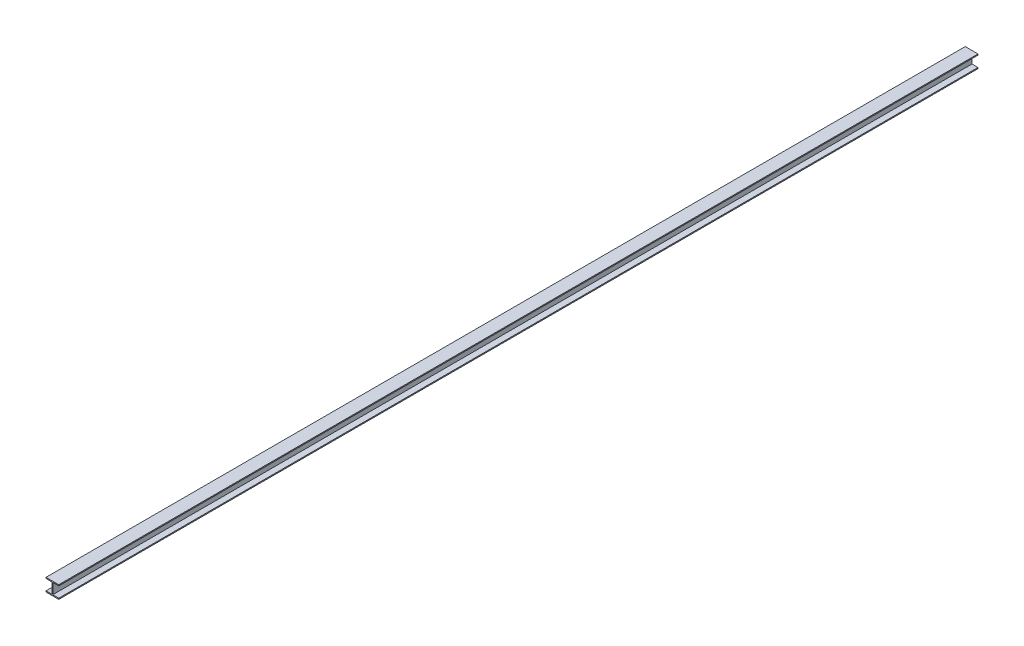
ISO-10303-21;
HEADER;
FILE_DESCRIPTION(('STEP AP214'),'2;1');
FILE_NAME('part.step','',(''),(''),'','','');
FILE_SCHEMA(('AUTOMOTIVE_DESIGN { 1 0 10303 214 1 1 1 1 }'));
ENDSEC;
DATA;
#1=APPLICATION_CONTEXT('core data for automotive mechanical design processes');
#2=APPLICATION_PROTOCOL_DEFINITION('international standard','automotive_design',2000,#1);
#3=PRODUCT_CONTEXT('',#1,'mechanical');
#4=PRODUCT('Part','Part','',(#3));
#5=PRODUCT_RELATED_PRODUCT_CATEGORY('part','',(#4));
#6=PRODUCT_DEFINITION_FORMATION('','',#4);
#7=PRODUCT_DEFINITION_CONTEXT('part definition',#1,'design');
#8=PRODUCT_DEFINITION('design','',#6,#7);
#9=PRODUCT_DEFINITION_SHAPE('','',#8);
#10=(LENGTH_UNIT() NAMED_UNIT(*) SI_UNIT(.MILLI.,.METRE.));
#11=(NAMED_UNIT(*) PLANE_ANGLE_UNIT() SI_UNIT($,.RADIAN.));
#12=(NAMED_UNIT(*) SI_UNIT($,.STERADIAN.) SOLID_ANGLE_UNIT());
#13=UNCERTAINTY_MEASURE_WITH_UNIT(LENGTH_MEASURE(1.E-05),#10,'distance_accuracy_value','');
#14=(GEOMETRIC_REPRESENTATION_CONTEXT(3) GLOBAL_UNCERTAINTY_ASSIGNED_CONTEXT((#13)) GLOBAL_UNIT_ASSIGNED_CONTEXT((#10,
#11,#12)) REPRESENTATION_CONTEXT('',''));
#15=CARTESIAN_POINT('',(0.,0.,0.));
#16=DIRECTION('',(0.,0.,1.));
#17=DIRECTION('',(1.,0.,0.));
#18=AXIS2_PLACEMENT_3D('',#15,#16,#17);
#19=CARTESIAN_POINT('',(-63.5,106.0704,4572.));
#20=DIRECTION('',(1.,0.,0.));
#21=DIRECTION('',(0.,1.,0.));
#22=AXIS2_PLACEMENT_3D('',#19,#20,#21);
#23=PLANE('',#22);
#24=DIRECTION('',(0.,-1.,0.));
#25=VECTOR('',#24,1.);
#26=CARTESIAN_POINT('',(-63.5,106.0704,-4572.));
#27=LINE('',#26,#25);
#28=CARTESIAN_POINT('',(-63.5,116.5352,-4572.));
#29=VERTEX_POINT('',#28);
#30=CARTESIAN_POINT('',(-63.5,106.0704,-4572.));
#31=VERTEX_POINT('',#30);
#32=EDGE_CURVE('E154',#29,#31,#27,.T.);
#33=ORIENTED_EDGE('',*,*,#32,.T.);
#34=DIRECTION('',(0.,0.,-1.));
#35=VECTOR('',#34,1.);
#36=CARTESIAN_POINT('',(-63.5,106.0704,4572.));
#37=LINE('',#36,#35);
#38=CARTESIAN_POINT('',(-63.5,106.0704,4572.));
#39=VERTEX_POINT('',#38);
#40=EDGE_CURVE('E11',#39,#31,#37,.T.);
#41=ORIENTED_EDGE('',*,*,#40,.F.);
#42=DIRECTION('',(0.,-1.,0.));
#43=VECTOR('',#42,1.);
#44=CARTESIAN_POINT('',(-63.5,106.0704,4572.));
#45=LINE('',#44,#43);
#46=CARTESIAN_POINT('',(-63.5,116.5352,4572.));
#47=VERTEX_POINT('',#46);
#48=EDGE_CURVE('E176',#47,#39,#45,.T.);
#49=ORIENTED_EDGE('',*,*,#48,.F.);
#50=DIRECTION('',(0.,0.,-1.));
#51=VECTOR('',#50,1.);
#52=CARTESIAN_POINT('',(-63.5,116.5352,4572.));
#53=LINE('',#52,#51);
#54=EDGE_CURVE('E150',#47,#29,#53,.T.);
#55=ORIENTED_EDGE('',*,*,#54,.T.);
#56=EDGE_LOOP('',(#33,#41,#49,#55));
#57=FACE_BOUND('',#56,.T.);
#58=ADVANCED_FACE('F34',(#57),#23,.F.);
#59=CARTESIAN_POINT('',(-3.9751,106.0704,4572.));
#60=DIRECTION('',(0.,1.,0.));
#61=DIRECTION('',(-1.,0.,0.));
#62=AXIS2_PLACEMENT_3D('',#59,#60,#61);
#63=PLANE('',#62);
#64=DIRECTION('',(1.,0.,0.));
#65=VECTOR('',#64,1.);
#66=CARTESIAN_POINT('',(-3.9751,106.0704,-4572.));
#67=LINE('',#66,#65);
#68=CARTESIAN_POINT('',(-3.9751,106.0704,-4572.));
#69=VERTEX_POINT('',#68);
#70=EDGE_CURVE('E157',#31,#69,#67,.T.);
#71=ORIENTED_EDGE('',*,*,#70,.T.);
#72=DIRECTION('',(0.,0.,-1.));
#73=VECTOR('',#72,1.);
#74=CARTESIAN_POINT('',(-3.9751,106.0704,4572.));
#75=LINE('',#74,#73);
#76=CARTESIAN_POINT('',(-3.9751,106.0704,4572.));
#77=VERTEX_POINT('',#76);
#78=EDGE_CURVE('E42',#77,#69,#75,.T.);
#79=ORIENTED_EDGE('',*,*,#78,.F.);
#80=DIRECTION('',(1.,0.,0.));
#81=VECTOR('',#80,1.);
#82=CARTESIAN_POINT('',(-3.9751,106.0704,4572.));
#83=LINE('',#82,#81);
#84=EDGE_CURVE('E105',#39,#77,#83,.T.);
#85=ORIENTED_EDGE('',*,*,#84,.F.);
#86=ORIENTED_EDGE('',*,*,#40,.T.);
#87=EDGE_LOOP('',(#71,#79,#85,#86));
#88=FACE_BOUND('',#87,.T.);
#89=ADVANCED_FACE('F254',(#88),#63,.F.);
#90=CARTESIAN_POINT('',(-3.97510000000001,0.,4572.));
#91=DIRECTION('',(1.,0.,0.));
#92=DIRECTION('',(0.,1.,0.));
#93=AXIS2_PLACEMENT_3D('',#90,#91,#92);
#94=PLANE('',#93);
#95=DIRECTION('',(0.,-1.,0.));
#96=VECTOR('',#95,1.);
#97=CARTESIAN_POINT('',(-3.97510000000001,0.,-4572.));
#98=LINE('',#97,#96);
#99=CARTESIAN_POINT('',(-3.97510000000001,0.,-4572.));
#100=VERTEX_POINT('',#99);
#101=EDGE_CURVE('E159',#69,#100,#98,.T.);
#102=ORIENTED_EDGE('',*,*,#101,.T.);
#103=DIRECTION('',(0.,0.,-1.));
#104=VECTOR('',#103,1.);
#105=CARTESIAN_POINT('',(-3.97510000000001,0.,4572.));
#106=LINE('',#105,#104);
#107=CARTESIAN_POINT('',(-3.97510000000001,0.,4572.));
#108=VERTEX_POINT('',#107);
#109=EDGE_CURVE('E195',#108,#100,#106,.T.);
#110=ORIENTED_EDGE('',*,*,#109,.F.);
#111=DIRECTION('',(0.,-1.,0.));
#112=VECTOR('',#111,1.);
#113=CARTESIAN_POINT('',(-3.97510000000001,0.,4572.));
#114=LINE('',#113,#112);
#115=EDGE_CURVE('E203',#77,#108,#114,.T.);
#116=ORIENTED_EDGE('',*,*,#115,.F.);
#117=ORIENTED_EDGE('',*,*,#78,.T.);
#118=EDGE_LOOP('',(#102,#110,#116,#117));
#119=FACE_BOUND('',#118,.T.);
#120=ADVANCED_FACE('F201',(#119),#94,.F.);
#121=CARTESIAN_POINT('',(-63.5,0.,4572.));
#122=DIRECTION('',(0.,-1.,0.));
#123=DIRECTION('',(0.,0.,-1.));
#124=AXIS2_PLACEMENT_3D('',#121,#122,#123);
#125=PLANE('',#124);
#126=DIRECTION('',(-1.,0.,0.));
#127=VECTOR('',#126,1.);
#128=CARTESIAN_POINT('',(-63.5,0.,-4572.));
#129=LINE('',#128,#127);
#130=CARTESIAN_POINT('',(-63.5,0.,-4572.));
#131=VERTEX_POINT('',#130);
#132=EDGE_CURVE('E161',#100,#131,#129,.T.);
#133=ORIENTED_EDGE('',*,*,#132,.T.);
#134=DIRECTION('',(0.,0.,-1.));
#135=VECTOR('',#134,1.);
#136=CARTESIAN_POINT('',(-63.5,0.,4572.));
#137=LINE('',#136,#135);
#138=CARTESIAN_POINT('',(-63.5,0.,4572.));
#139=VERTEX_POINT('',#138);
#140=EDGE_CURVE('E192',#139,#131,#137,.T.);
#141=ORIENTED_EDGE('',*,*,#140,.F.);
#142=DIRECTION('',(-1.,0.,0.));
#143=VECTOR('',#142,1.);
#144=CARTESIAN_POINT('',(-63.5,0.,4572.));
#145=LINE('',#144,#143);
#146=EDGE_CURVE('E221',#108,#139,#145,.T.);
#147=ORIENTED_EDGE('',*,*,#146,.F.);
#148=ORIENTED_EDGE('',*,*,#109,.T.);
#149=EDGE_LOOP('',(#133,#141,#147,#148));
#150=FACE_BOUND('',#149,.T.);
#151=ADVANCED_FACE('F212',(#150),#125,.F.);
#152=CARTESIAN_POINT('',(-63.5,-10.4648,4572.));
#153=DIRECTION('',(1.,0.,0.));
#154=DIRECTION('',(0.,1.,0.));
#155=AXIS2_PLACEMENT_3D('',#152,#153,#154);
#156=PLANE('',#155);
#157=DIRECTION('',(0.,-1.,0.));
#158=VECTOR('',#157,1.);
#159=CARTESIAN_POINT('',(-63.5,-10.4648,-4572.));
#160=LINE('',#159,#158);
#161=CARTESIAN_POINT('',(-63.5,-10.4648,-4572.));
#162=VERTEX_POINT('',#161);
#163=EDGE_CURVE('E163',#131,#162,#160,.T.);
#164=ORIENTED_EDGE('',*,*,#163,.T.);
#165=DIRECTION('',(0.,0.,-1.));
#166=VECTOR('',#165,1.);
#167=CARTESIAN_POINT('',(-63.5,-10.4648,4572.));
#168=LINE('',#167,#166);
#169=CARTESIAN_POINT('',(-63.5,-10.4648,4572.));
#170=VERTEX_POINT('',#169);
#171=EDGE_CURVE('E189',#170,#162,#168,.T.);
#172=ORIENTED_EDGE('',*,*,#171,.F.);
#173=DIRECTION('',(0.,-1.,0.));
#174=VECTOR('',#173,1.);
#175=CARTESIAN_POINT('',(-63.5,-10.4648,4572.));
#176=LINE('',#175,#174);
#177=EDGE_CURVE('E218',#139,#170,#176,.T.);
#178=ORIENTED_EDGE('',*,*,#177,.F.);
#179=ORIENTED_EDGE('',*,*,#140,.T.);
#180=EDGE_LOOP('',(#164,#172,#178,#179));
#181=FACE_BOUND('',#180,.T.);
#182=ADVANCED_FACE('F216',(#181),#156,.F.);
#183=CARTESIAN_POINT('',(63.5,-10.4648,4572.));
#184=DIRECTION('',(0.,1.,0.));
#185=DIRECTION('',(0.,0.,1.));
#186=AXIS2_PLACEMENT_3D('',#183,#184,#185);
#187=PLANE('',#186);
#188=DIRECTION('',(1.,0.,0.));
#189=VECTOR('',#188,1.);
#190=CARTESIAN_POINT('',(63.5,-10.4648,-4572.));
#191=LINE('',#190,#189);
#192=CARTESIAN_POINT('',(63.5,-10.4648,-4572.));
#193=VERTEX_POINT('',#192);
#194=EDGE_CURVE('E165',#162,#193,#191,.T.);
#195=ORIENTED_EDGE('',*,*,#194,.T.);
#196=DIRECTION('',(0.,0.,-1.));
#197=VECTOR('',#196,1.);
#198=CARTESIAN_POINT('',(63.5,-10.4648,4572.));
#199=LINE('',#198,#197);
#200=CARTESIAN_POINT('',(63.5,-10.4648,4572.));
#201=VERTEX_POINT('',#200);
#202=EDGE_CURVE('E186',#201,#193,#199,.T.);
#203=ORIENTED_EDGE('',*,*,#202,.F.);
#204=DIRECTION('',(1.,0.,0.));
#205=VECTOR('',#204,1.);
#206=CARTESIAN_POINT('',(63.5,-10.4648,4572.));
#207=LINE('',#206,#205);
#208=EDGE_CURVE('E220',#170,#201,#207,.T.);
#209=ORIENTED_EDGE('',*,*,#208,.F.);
#210=ORIENTED_EDGE('',*,*,#171,.T.);
#211=EDGE_LOOP('',(#195,#203,#209,#210));
#212=FACE_BOUND('',#211,.T.);
#213=ADVANCED_FACE('F267',(#212),#187,.F.);
#214=CARTESIAN_POINT('',(63.5,0.,4572.));
#215=DIRECTION('',(-1.,0.,0.));
#216=DIRECTION('',(0.,-1.,0.));
#217=AXIS2_PLACEMENT_3D('',#214,#215,#216);
#218=PLANE('',#217);
#219=DIRECTION('',(0.,1.,0.));
#220=VECTOR('',#219,1.);
#221=CARTESIAN_POINT('',(63.5,0.,-4572.));
#222=LINE('',#221,#220);
#223=CARTESIAN_POINT('',(63.5,0.,-4572.));
#224=VERTEX_POINT('',#223);
#225=EDGE_CURVE('E167',#193,#224,#222,.T.);
#226=ORIENTED_EDGE('',*,*,#225,.T.);
#227=DIRECTION('',(0.,0.,-1.));
#228=VECTOR('',#227,1.);
#229=CARTESIAN_POINT('',(63.5,0.,4572.));
#230=LINE('',#229,#228);
#231=CARTESIAN_POINT('',(63.5,0.,4572.));
#232=VERTEX_POINT('',#231);
#233=EDGE_CURVE('E183',#232,#224,#230,.T.);
#234=ORIENTED_EDGE('',*,*,#233,.F.);
#235=DIRECTION('',(0.,1.,0.));
#236=VECTOR('',#235,1.);
#237=CARTESIAN_POINT('',(63.5,0.,4572.));
#238=LINE('',#237,#236);
#239=EDGE_CURVE('E223',#201,#232,#238,.T.);
#240=ORIENTED_EDGE('',*,*,#239,.F.);
#241=ORIENTED_EDGE('',*,*,#202,.T.);
#242=EDGE_LOOP('',(#226,#234,#240,#241));
#243=FACE_BOUND('',#242,.T.);
#244=ADVANCED_FACE('F270',(#243),#218,.F.);
#245=CARTESIAN_POINT('',(3.97510000000001,0.,4572.));
#246=DIRECTION('',(0.,-1.,0.));
#247=DIRECTION('',(0.,0.,-1.));
#248=AXIS2_PLACEMENT_3D('',#245,#246,#247);
#249=PLANE('',#248);
#250=DIRECTION('',(-1.,0.,0.));
#251=VECTOR('',#250,1.);
#252=CARTESIAN_POINT('',(3.97510000000001,0.,-4572.));
#253=LINE('',#252,#251);
#254=CARTESIAN_POINT('',(3.97510000000001,0.,-4572.));
#255=VERTEX_POINT('',#254);
#256=EDGE_CURVE('E169',#224,#255,#253,.T.);
#257=ORIENTED_EDGE('',*,*,#256,.T.);
#258=DIRECTION('',(0.,0.,-1.));
#259=VECTOR('',#258,1.);
#260=CARTESIAN_POINT('',(3.97510000000001,0.,4572.));
#261=LINE('',#260,#259);
#262=CARTESIAN_POINT('',(3.97510000000001,0.,4572.));
#263=VERTEX_POINT('',#262);
#264=EDGE_CURVE('E180',#263,#255,#261,.T.);
#265=ORIENTED_EDGE('',*,*,#264,.F.);
#266=DIRECTION('',(-1.,0.,0.));
#267=VECTOR('',#266,1.);
#268=CARTESIAN_POINT('',(3.97510000000001,0.,4572.));
#269=LINE('',#268,#267);
#270=EDGE_CURVE('E229',#232,#263,#269,.T.);
#271=ORIENTED_EDGE('',*,*,#270,.F.);
#272=ORIENTED_EDGE('',*,*,#233,.T.);
#273=EDGE_LOOP('',(#257,#265,#271,#272));
#274=FACE_BOUND('',#273,.T.);
#275=ADVANCED_FACE('F235',(#274),#249,.F.);
#276=CARTESIAN_POINT('',(3.9751,106.0704,4572.));
#277=DIRECTION('',(-1.,0.,0.));
#278=DIRECTION('',(0.,-1.,0.));
#279=AXIS2_PLACEMENT_3D('',#276,#277,#278);
#280=PLANE('',#279);
#281=DIRECTION('',(0.,1.,0.));
#282=VECTOR('',#281,1.);
#283=CARTESIAN_POINT('',(3.9751,106.0704,-4572.));
#284=LINE('',#283,#282);
#285=CARTESIAN_POINT('',(3.9751,106.0704,-4572.));
#286=VERTEX_POINT('',#285);
#287=EDGE_CURVE('E171',#255,#286,#284,.T.);
#288=ORIENTED_EDGE('',*,*,#287,.T.);
#289=DIRECTION('',(0.,0.,-1.));
#290=VECTOR('',#289,1.);
#291=CARTESIAN_POINT('',(3.9751,106.0704,4572.));
#292=LINE('',#291,#290);
#293=CARTESIAN_POINT('',(3.9751,106.0704,4572.));
#294=VERTEX_POINT('',#293);
#295=EDGE_CURVE('E145',#294,#286,#292,.T.);
#296=ORIENTED_EDGE('',*,*,#295,.F.);
#297=DIRECTION('',(0.,1.,0.));
#298=VECTOR('',#297,1.);
#299=CARTESIAN_POINT('',(3.9751,106.0704,4572.));
#300=LINE('',#299,#298);
#301=EDGE_CURVE('E136',#263,#294,#300,.T.);
#302=ORIENTED_EDGE('',*,*,#301,.F.);
#303=ORIENTED_EDGE('',*,*,#264,.T.);
#304=EDGE_LOOP('',(#288,#296,#302,#303));
#305=FACE_BOUND('',#304,.T.);
#306=ADVANCED_FACE('F239',(#305),#280,.F.);
#307=CARTESIAN_POINT('',(63.5,106.0704,4572.));
#308=DIRECTION('',(0.,1.,0.));
#309=DIRECTION('',(-1.,0.,0.));
#310=AXIS2_PLACEMENT_3D('',#307,#308,#309);
#311=PLANE('',#310);
#312=DIRECTION('',(1.,0.,0.));
#313=VECTOR('',#312,1.);
#314=CARTESIAN_POINT('',(63.5,106.0704,-4572.));
#315=LINE('',#314,#313);
#316=CARTESIAN_POINT('',(63.5,106.0704,-4572.));
#317=VERTEX_POINT('',#316);
#318=EDGE_CURVE('E144',#286,#317,#315,.T.);
#319=ORIENTED_EDGE('',*,*,#318,.T.);
#320=DIRECTION('',(0.,0.,-1.));
#321=VECTOR('',#320,1.);
#322=CARTESIAN_POINT('',(63.5,106.0704,4572.));
#323=LINE('',#322,#321);
#324=CARTESIAN_POINT('',(63.5,106.0704,4572.));
#325=VERTEX_POINT('',#324);
#326=EDGE_CURVE('E141',#325,#317,#323,.T.);
#327=ORIENTED_EDGE('',*,*,#326,.F.);
#328=DIRECTION('',(1.,0.,0.));
#329=VECTOR('',#328,1.);
#330=CARTESIAN_POINT('',(63.5,106.0704,4572.));
#331=LINE('',#330,#329);
#332=EDGE_CURVE('E130',#294,#325,#331,.T.);
#333=ORIENTED_EDGE('',*,*,#332,.F.);
#334=ORIENTED_EDGE('',*,*,#295,.T.);
#335=EDGE_LOOP('',(#319,#327,#333,#334));
#336=FACE_BOUND('',#335,.T.);
#337=ADVANCED_FACE('F142',(#336),#311,.F.);
#338=CARTESIAN_POINT('',(63.5,116.5352,4572.));
#339=DIRECTION('',(-1.,0.,0.));
#340=DIRECTION('',(0.,-1.,0.));
#341=AXIS2_PLACEMENT_3D('',#338,#339,#340);
#342=PLANE('',#341);
#343=DIRECTION('',(0.,1.,0.));
#344=VECTOR('',#343,1.);
#345=CARTESIAN_POINT('',(63.5,116.5352,-4572.));
#346=LINE('',#345,#344);
#347=CARTESIAN_POINT('',(63.5,116.5352,-4572.));
#348=VERTEX_POINT('',#347);
#349=EDGE_CURVE('E91',#317,#348,#346,.T.);
#350=ORIENTED_EDGE('',*,*,#349,.T.);
#351=DIRECTION('',(0.,0.,-1.));
#352=VECTOR('',#351,1.);
#353=CARTESIAN_POINT('',(63.5,116.5352,4572.));
#354=LINE('',#353,#352);
#355=CARTESIAN_POINT('',(63.5,116.5352,4572.));
#356=VERTEX_POINT('',#355);
#357=EDGE_CURVE('E146',#356,#348,#354,.T.);
#358=ORIENTED_EDGE('',*,*,#357,.F.);
#359=DIRECTION('',(0.,1.,0.));
#360=VECTOR('',#359,1.);
#361=CARTESIAN_POINT('',(63.5,116.5352,4572.));
#362=LINE('',#361,#360);
#363=EDGE_CURVE('E134',#325,#356,#362,.T.);
#364=ORIENTED_EDGE('',*,*,#363,.F.);
#365=ORIENTED_EDGE('',*,*,#326,.T.);
#366=EDGE_LOOP('',(#350,#358,#364,#365));
#367=FACE_BOUND('',#366,.T.);
#368=ADVANCED_FACE('F148',(#367),#342,.F.);
#369=CARTESIAN_POINT('',(-63.5,116.5352,4572.));
#370=DIRECTION('',(0.,-1.,0.));
#371=DIRECTION('',(0.,0.,-1.));
#372=AXIS2_PLACEMENT_3D('',#369,#370,#371);
#373=PLANE('',#372);
#374=DIRECTION('',(-1.,0.,0.));
#375=VECTOR('',#374,1.);
#376=CARTESIAN_POINT('',(-63.5,116.5352,-4572.));
#377=LINE('',#376,#375);
#378=EDGE_CURVE('E97',#348,#29,#377,.T.);
#379=ORIENTED_EDGE('',*,*,#378,.T.);
#380=ORIENTED_EDGE('',*,*,#54,.F.);
#381=DIRECTION('',(-1.,0.,0.));
#382=VECTOR('',#381,1.);
#383=CARTESIAN_POINT('',(-63.5,116.5352,4572.));
#384=LINE('',#383,#382);
#385=EDGE_CURVE('E50',#356,#47,#384,.T.);
#386=ORIENTED_EDGE('',*,*,#385,.F.);
#387=ORIENTED_EDGE('',*,*,#357,.T.);
#388=EDGE_LOOP('',(#379,#380,#386,#387));
#389=FACE_BOUND('',#388,.T.);
#390=ADVANCED_FACE('F243',(#389),#373,.F.);
#391=CARTESIAN_POINT('',(0.,0.,4572.));
#392=DIRECTION('',(0.,0.,-1.));
#393=DIRECTION('',(-1.,0.,0.));
#394=AXIS2_PLACEMENT_3D('',#391,#392,#393);
#395=PLANE('',#394);
#396=ORIENTED_EDGE('',*,*,#48,.T.);
#397=ORIENTED_EDGE('',*,*,#84,.T.);
#398=ORIENTED_EDGE('',*,*,#115,.T.);
#399=ORIENTED_EDGE('',*,*,#146,.T.);
#400=ORIENTED_EDGE('',*,*,#177,.T.);
#401=ORIENTED_EDGE('',*,*,#208,.T.);
#402=ORIENTED_EDGE('',*,*,#239,.T.);
#403=ORIENTED_EDGE('',*,*,#270,.T.);
#404=ORIENTED_EDGE('',*,*,#301,.T.);
#405=ORIENTED_EDGE('',*,*,#332,.T.);
#406=ORIENTED_EDGE('',*,*,#363,.T.);
#407=ORIENTED_EDGE('',*,*,#385,.T.);
#408=EDGE_LOOP('',(#396,#397,#398,#399,#400,#401,#402,#403,#404,#405,#406,#407));
#409=FACE_BOUND('',#408,.T.);
#410=ADVANCED_FACE('F132',(#409),#395,.F.);
#411=CARTESIAN_POINT('',(0.,0.,-4572.));
#412=DIRECTION('',(0.,0.,-1.));
#413=DIRECTION('',(-1.,0.,0.));
#414=AXIS2_PLACEMENT_3D('',#411,#412,#413);
#415=PLANE('',#414);
#416=ORIENTED_EDGE('',*,*,#32,.F.);
#417=ORIENTED_EDGE('',*,*,#378,.F.);
#418=ORIENTED_EDGE('',*,*,#349,.F.);
#419=ORIENTED_EDGE('',*,*,#318,.F.);
#420=ORIENTED_EDGE('',*,*,#287,.F.);
#421=ORIENTED_EDGE('',*,*,#256,.F.);
#422=ORIENTED_EDGE('',*,*,#225,.F.);
#423=ORIENTED_EDGE('',*,*,#194,.F.);
#424=ORIENTED_EDGE('',*,*,#163,.F.);
#425=ORIENTED_EDGE('',*,*,#132,.F.);
#426=ORIENTED_EDGE('',*,*,#101,.F.);
#427=ORIENTED_EDGE('',*,*,#70,.F.);
#428=EDGE_LOOP('',(#416,#417,#418,#419,#420,#421,#422,#423,#424,#425,#426,#427));
#429=FACE_BOUND('',#428,.T.);
#430=ADVANCED_FACE('F207',(#429),#415,.T.);
#431=CLOSED_SHELL('',(#58,#89,#120,#151,#182,#213,#244,#275,#306,#337,#368,#390,#410,#430));
#432=MANIFOLD_SOLID_BREP('B2',#431);
#433=ADVANCED_BREP_SHAPE_REPRESENTATION('',(#18,#432),#14);
#434=SHAPE_DEFINITION_REPRESENTATION(#9,#433);
ENDSEC;
END-ISO-10303-21;
